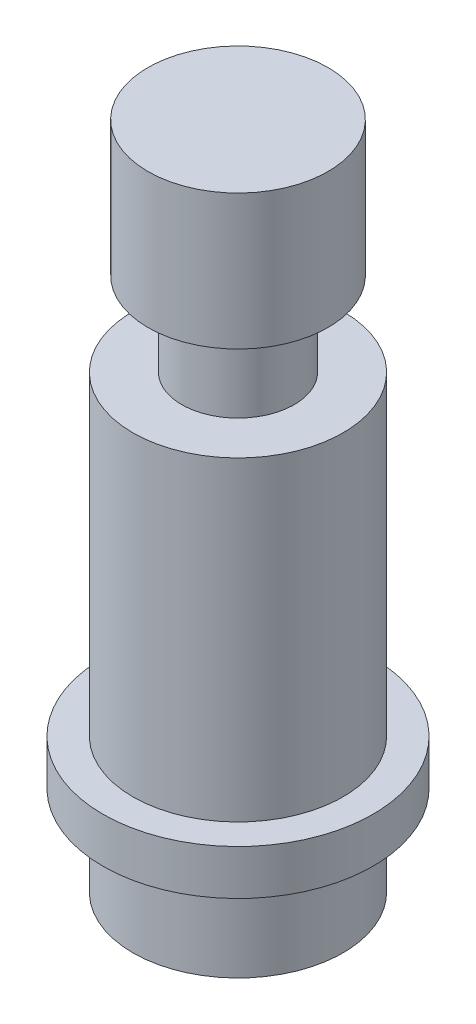
ISO-10303-21;
HEADER;
FILE_DESCRIPTION(('STEP AP214'),'2;1');
FILE_NAME('part.step','',(''),(''),'','','');
FILE_SCHEMA(('AUTOMOTIVE_DESIGN { 1 0 10303 214 1 1 1 1 }'));
ENDSEC;
DATA;
#1=APPLICATION_CONTEXT('core data for automotive mechanical design processes');
#2=APPLICATION_PROTOCOL_DEFINITION('international standard','automotive_design',2000,#1);
#3=PRODUCT_CONTEXT('',#1,'mechanical');
#4=PRODUCT('Part','Part','',(#3));
#5=PRODUCT_RELATED_PRODUCT_CATEGORY('part','',(#4));
#6=PRODUCT_DEFINITION_FORMATION('','',#4);
#7=PRODUCT_DEFINITION_CONTEXT('part definition',#1,'design');
#8=PRODUCT_DEFINITION('design','',#6,#7);
#9=PRODUCT_DEFINITION_SHAPE('','',#8);
#10=(LENGTH_UNIT() NAMED_UNIT(*) SI_UNIT(.MILLI.,.METRE.));
#11=(NAMED_UNIT(*) PLANE_ANGLE_UNIT() SI_UNIT($,.RADIAN.));
#12=(NAMED_UNIT(*) SI_UNIT($,.STERADIAN.) SOLID_ANGLE_UNIT());
#13=UNCERTAINTY_MEASURE_WITH_UNIT(LENGTH_MEASURE(1.E-05),#10,'distance_accuracy_value','');
#14=(GEOMETRIC_REPRESENTATION_CONTEXT(3) GLOBAL_UNCERTAINTY_ASSIGNED_CONTEXT((#13)) GLOBAL_UNIT_ASSIGNED_CONTEXT((#10,
#11,#12)) REPRESENTATION_CONTEXT('',''));
#15=CARTESIAN_POINT('',(0.,0.,0.));
#16=DIRECTION('',(0.,0.,1.));
#17=DIRECTION('',(1.,0.,0.));
#18=AXIS2_PLACEMENT_3D('',#15,#16,#17);
#19=CARTESIAN_POINT('',(0.,0.,0.));
#20=DIRECTION('',(0.,1.,0.));
#21=DIRECTION('',(0.,0.,1.));
#22=AXIS2_PLACEMENT_3D('',#19,#20,#21);
#23=PLANE('',#22);
#24=CARTESIAN_POINT('',(0.,0.,0.));
#25=DIRECTION('',(0.,-1.,0.));
#26=DIRECTION('',(0.,0.,-1.));
#27=AXIS2_PLACEMENT_3D('',#24,#25,#26);
#28=CIRCLE('',#27,7.);
#29=CARTESIAN_POINT('',(0.,0.,-7.));
#30=VERTEX_POINT('',#29);
#31=EDGE_CURVE('E10',#30,#30,#28,.T.);
#32=ORIENTED_EDGE('',*,*,#31,.T.);
#33=EDGE_LOOP('',(#32));
#34=FACE_BOUND('',#33,.T.);
#35=ADVANCED_FACE('F35',(#34),#23,.F.);
#36=CARTESIAN_POINT('',(0.,0.,0.));
#37=DIRECTION('',(0.,-1.,0.));
#38=DIRECTION('',(0.,0.,-1.));
#39=AXIS2_PLACEMENT_3D('',#36,#37,#38);
#40=CYLINDRICAL_SURFACE('',#39,7.);
#41=ORIENTED_EDGE('',*,*,#31,.F.);
#42=EDGE_LOOP('',(#41));
#43=FACE_BOUND('',#42,.T.);
#44=CARTESIAN_POINT('',(0.,5.99999999999999,0.));
#45=DIRECTION('',(0.,-1.,0.));
#46=DIRECTION('',(0.,0.,-1.));
#47=AXIS2_PLACEMENT_3D('',#44,#45,#46);
#48=CIRCLE('',#47,7.);
#49=CARTESIAN_POINT('',(0.,5.99999999999999,-7.));
#50=VERTEX_POINT('',#49);
#51=EDGE_CURVE('E41',#50,#50,#48,.T.);
#52=ORIENTED_EDGE('',*,*,#51,.T.);
#53=EDGE_LOOP('',(#52));
#54=FACE_BOUND('',#53,.T.);
#55=ADVANCED_FACE('F85',(#43,#54),#40,.T.);
#56=CARTESIAN_POINT('',(0.,5.99999999999999,7.));
#57=DIRECTION('',(0.,1.,0.));
#58=DIRECTION('',(0.,0.,1.));
#59=AXIS2_PLACEMENT_3D('',#56,#57,#58);
#60=PLANE('',#59);
#61=ORIENTED_EDGE('',*,*,#51,.F.);
#62=EDGE_LOOP('',(#61));
#63=FACE_BOUND('',#62,.T.);
#64=CARTESIAN_POINT('',(0.,5.99999999999999,0.));
#65=DIRECTION('',(0.,-1.,0.));
#66=DIRECTION('',(0.,0.,-1.));
#67=AXIS2_PLACEMENT_3D('',#64,#65,#66);
#68=CIRCLE('',#67,9.);
#69=CARTESIAN_POINT('',(0.,5.99999999999999,-9.));
#70=VERTEX_POINT('',#69);
#71=EDGE_CURVE('E45',#70,#70,#68,.T.);
#72=ORIENTED_EDGE('',*,*,#71,.T.);
#73=EDGE_LOOP('',(#72));
#74=FACE_BOUND('',#73,.T.);
#75=ADVANCED_FACE('F89',(#63,#74),#60,.F.);
#76=CARTESIAN_POINT('',(0.,0.,0.));
#77=DIRECTION('',(0.,-1.,0.));
#78=DIRECTION('',(0.,0.,-1.));
#79=AXIS2_PLACEMENT_3D('',#76,#77,#78);
#80=CYLINDRICAL_SURFACE('',#79,9.);
#81=ORIENTED_EDGE('',*,*,#71,.F.);
#82=EDGE_LOOP('',(#81));
#83=FACE_BOUND('',#82,.T.);
#84=CARTESIAN_POINT('',(0.,8.99999999999999,0.));
#85=DIRECTION('',(0.,-1.,0.));
#86=DIRECTION('',(0.,0.,-1.));
#87=AXIS2_PLACEMENT_3D('',#84,#85,#86);
#88=CIRCLE('',#87,9.);
#89=CARTESIAN_POINT('',(0.,8.99999999999999,-9.));
#90=VERTEX_POINT('',#89);
#91=EDGE_CURVE('E49',#90,#90,#88,.T.);
#92=ORIENTED_EDGE('',*,*,#91,.T.);
#93=EDGE_LOOP('',(#92));
#94=FACE_BOUND('',#93,.T.);
#95=ADVANCED_FACE('F94',(#83,#94),#80,.T.);
#96=CARTESIAN_POINT('',(0.,8.99999999999999,9.));
#97=DIRECTION('',(0.,-1.,0.));
#98=DIRECTION('',(0.,0.,-1.));
#99=AXIS2_PLACEMENT_3D('',#96,#97,#98);
#100=PLANE('',#99);
#101=ORIENTED_EDGE('',*,*,#91,.F.);
#102=EDGE_LOOP('',(#101));
#103=FACE_BOUND('',#102,.T.);
#104=CARTESIAN_POINT('',(0.,8.99999999999999,0.));
#105=DIRECTION('',(0.,-1.,0.));
#106=DIRECTION('',(0.,0.,-1.));
#107=AXIS2_PLACEMENT_3D('',#104,#105,#106);
#108=CIRCLE('',#107,6.99999999999999);
#109=CARTESIAN_POINT('',(0.,8.99999999999999,-6.99999999999999));
#110=VERTEX_POINT('',#109);
#111=EDGE_CURVE('E54',#110,#110,#108,.T.);
#112=ORIENTED_EDGE('',*,*,#111,.T.);
#113=EDGE_LOOP('',(#112));
#114=FACE_BOUND('',#113,.T.);
#115=ADVANCED_FACE('F100',(#103,#114),#100,.F.);
#116=CARTESIAN_POINT('',(0.,0.,0.));
#117=DIRECTION('',(0.,-1.,0.));
#118=DIRECTION('',(0.,0.,-1.));
#119=AXIS2_PLACEMENT_3D('',#116,#117,#118);
#120=CYLINDRICAL_SURFACE('',#119,6.99999999999999);
#121=ORIENTED_EDGE('',*,*,#111,.F.);
#122=EDGE_LOOP('',(#121));
#123=FACE_BOUND('',#122,.T.);
#124=CARTESIAN_POINT('',(0.,30.,0.));
#125=DIRECTION('',(0.,-1.,0.));
#126=DIRECTION('',(0.,0.,-1.));
#127=AXIS2_PLACEMENT_3D('',#124,#125,#126);
#128=CIRCLE('',#127,6.99999999999999);
#129=CARTESIAN_POINT('',(0.,30.,-6.99999999999999));
#130=VERTEX_POINT('',#129);
#131=EDGE_CURVE('E57',#130,#130,#128,.T.);
#132=ORIENTED_EDGE('',*,*,#131,.T.);
#133=EDGE_LOOP('',(#132));
#134=FACE_BOUND('',#133,.T.);
#135=ADVANCED_FACE('F104',(#123,#134),#120,.T.);
#136=CARTESIAN_POINT('',(0.,30.,6.99999999999999));
#137=DIRECTION('',(0.,-1.,0.));
#138=DIRECTION('',(0.,0.,-1.));
#139=AXIS2_PLACEMENT_3D('',#136,#137,#138);
#140=PLANE('',#139);
#141=ORIENTED_EDGE('',*,*,#131,.F.);
#142=EDGE_LOOP('',(#141));
#143=FACE_BOUND('',#142,.T.);
#144=CARTESIAN_POINT('',(0.,30.,0.));
#145=DIRECTION('',(0.,-1.,0.));
#146=DIRECTION('',(0.,0.,-1.));
#147=AXIS2_PLACEMENT_3D('',#144,#145,#146);
#148=CIRCLE('',#147,3.75);
#149=CARTESIAN_POINT('',(0.,30.,-3.75));
#150=VERTEX_POINT('',#149);
#151=EDGE_CURVE('E60',#150,#150,#148,.T.);
#152=ORIENTED_EDGE('',*,*,#151,.T.);
#153=EDGE_LOOP('',(#152));
#154=FACE_BOUND('',#153,.T.);
#155=ADVANCED_FACE('F108',(#143,#154),#140,.F.);
#156=CARTESIAN_POINT('',(0.,0.,0.));
#157=DIRECTION('',(0.,-1.,0.));
#158=DIRECTION('',(0.,0.,-1.));
#159=AXIS2_PLACEMENT_3D('',#156,#157,#158);
#160=CYLINDRICAL_SURFACE('',#159,3.75);
#161=ORIENTED_EDGE('',*,*,#151,.F.);
#162=EDGE_LOOP('',(#161));
#163=FACE_BOUND('',#162,.T.);
#164=CARTESIAN_POINT('',(0.,35.5738748562837,0.));
#165=DIRECTION('',(0.,-1.,0.));
#166=DIRECTION('',(0.,0.,-1.));
#167=AXIS2_PLACEMENT_3D('',#164,#165,#166);
#168=CIRCLE('',#167,3.75);
#169=CARTESIAN_POINT('',(0.,35.5738748562837,-3.75));
#170=VERTEX_POINT('',#169);
#171=EDGE_CURVE('E63',#170,#170,#168,.T.);
#172=ORIENTED_EDGE('',*,*,#171,.T.);
#173=EDGE_LOOP('',(#172));
#174=FACE_BOUND('',#173,.T.);
#175=ADVANCED_FACE('F112',(#163,#174),#160,.T.);
#176=CARTESIAN_POINT('',(0.,35.5738748562837,3.75));
#177=DIRECTION('',(0.,1.,0.));
#178=DIRECTION('',(0.,0.,1.));
#179=AXIS2_PLACEMENT_3D('',#176,#177,#178);
#180=PLANE('',#179);
#181=ORIENTED_EDGE('',*,*,#171,.F.);
#182=EDGE_LOOP('',(#181));
#183=FACE_BOUND('',#182,.T.);
#184=CARTESIAN_POINT('',(0.,35.5738748562837,0.));
#185=DIRECTION('',(0.,-1.,0.));
#186=DIRECTION('',(0.,0.,-1.));
#187=AXIS2_PLACEMENT_3D('',#184,#185,#186);
#188=CIRCLE('',#187,6.);
#189=CARTESIAN_POINT('',(0.,35.5738748562837,-6.));
#190=VERTEX_POINT('',#189);
#191=EDGE_CURVE('E66',#190,#190,#188,.T.);
#192=ORIENTED_EDGE('',*,*,#191,.T.);
#193=EDGE_LOOP('',(#192));
#194=FACE_BOUND('',#193,.T.);
#195=ADVANCED_FACE('F81',(#183,#194),#180,.F.);
#196=CARTESIAN_POINT('',(0.,0.,0.));
#197=DIRECTION('',(0.,-1.,0.));
#198=DIRECTION('',(0.,0.,-1.));
#199=AXIS2_PLACEMENT_3D('',#196,#197,#198);
#200=CYLINDRICAL_SURFACE('',#199,6.);
#201=ORIENTED_EDGE('',*,*,#191,.F.);
#202=EDGE_LOOP('',(#201));
#203=FACE_BOUND('',#202,.T.);
#204=CARTESIAN_POINT('',(0.,44.5738748562837,0.));
#205=DIRECTION('',(0.,-1.,0.));
#206=DIRECTION('',(0.,0.,-1.));
#207=AXIS2_PLACEMENT_3D('',#204,#205,#206);
#208=CIRCLE('',#207,6.);
#209=CARTESIAN_POINT('',(0.,44.5738748562837,-6.));
#210=VERTEX_POINT('',#209);
#211=EDGE_CURVE('E69',#210,#210,#208,.T.);
#212=ORIENTED_EDGE('',*,*,#211,.T.);
#213=EDGE_LOOP('',(#212));
#214=FACE_BOUND('',#213,.T.);
#215=ADVANCED_FACE('F73',(#203,#214),#200,.T.);
#216=CARTESIAN_POINT('',(0.,44.5738748562837,6.));
#217=DIRECTION('',(0.,-1.,0.));
#218=DIRECTION('',(0.,0.,-1.));
#219=AXIS2_PLACEMENT_3D('',#216,#217,#218);
#220=PLANE('',#219);
#221=ORIENTED_EDGE('',*,*,#211,.F.);
#222=EDGE_LOOP('',(#221));
#223=FACE_BOUND('',#222,.T.);
#224=ADVANCED_FACE('F75',(#223),#220,.F.);
#225=CLOSED_SHELL('',(#35,#55,#75,#95,#115,#135,#155,#175,#195,#215,#224));
#226=MANIFOLD_SOLID_BREP('B2',#225);
#227=ADVANCED_BREP_SHAPE_REPRESENTATION('',(#18,#226),#14);
#228=SHAPE_DEFINITION_REPRESENTATION(#9,#227);
ENDSEC;
END-ISO-10303-21;
